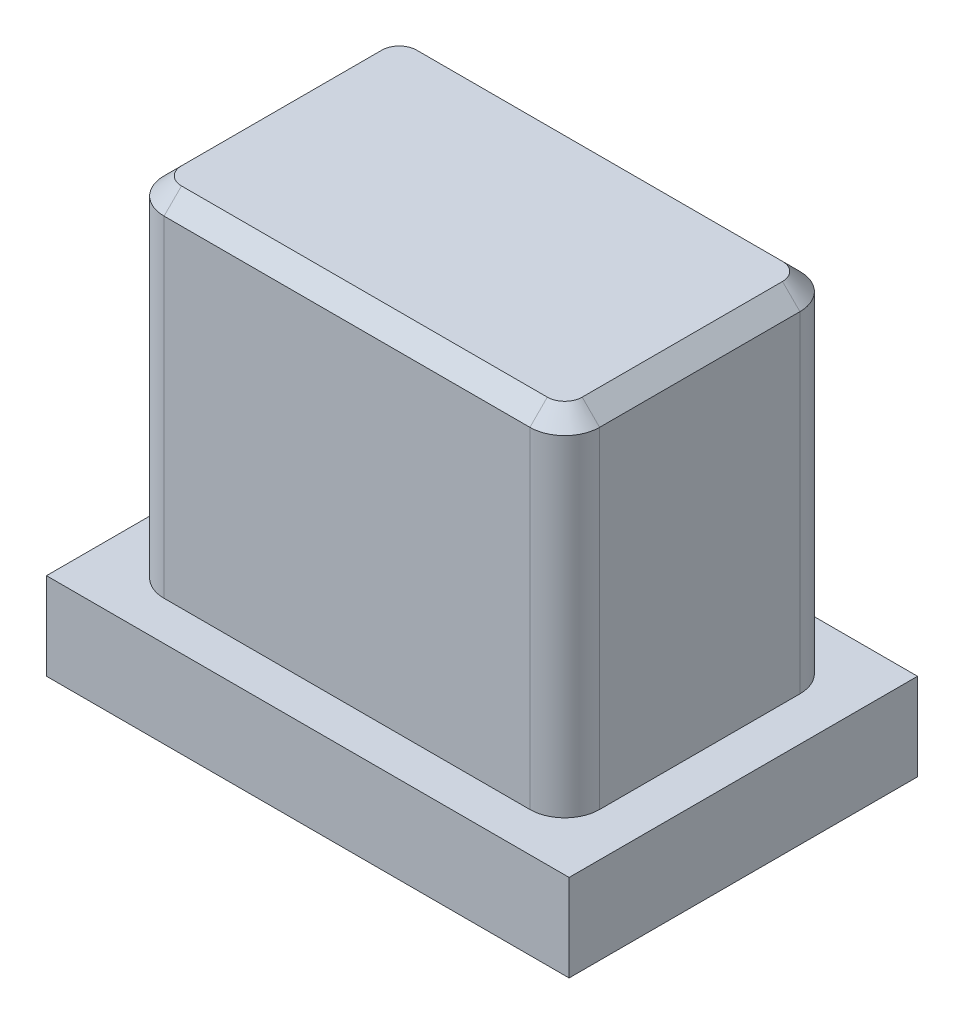
ISO-10303-21;
HEADER;
FILE_DESCRIPTION(('STEP AP214'),'2;1');
FILE_NAME('part.step','',(''),(''),'','','');
FILE_SCHEMA(('AUTOMOTIVE_DESIGN { 1 0 10303 214 1 1 1 1 }'));
ENDSEC;
DATA;
#1=APPLICATION_CONTEXT('core data for automotive mechanical design processes');
#2=APPLICATION_PROTOCOL_DEFINITION('international standard','automotive_design',2000,#1);
#3=PRODUCT_CONTEXT('',#1,'mechanical');
#4=PRODUCT('Part','Part','',(#3));
#5=PRODUCT_RELATED_PRODUCT_CATEGORY('part','',(#4));
#6=PRODUCT_DEFINITION_FORMATION('','',#4);
#7=PRODUCT_DEFINITION_CONTEXT('part definition',#1,'design');
#8=PRODUCT_DEFINITION('design','',#6,#7);
#9=PRODUCT_DEFINITION_SHAPE('','',#8);
#10=(LENGTH_UNIT() NAMED_UNIT(*) SI_UNIT(.MILLI.,.METRE.));
#11=(NAMED_UNIT(*) PLANE_ANGLE_UNIT() SI_UNIT($,.RADIAN.));
#12=(NAMED_UNIT(*) SI_UNIT($,.STERADIAN.) SOLID_ANGLE_UNIT());
#13=UNCERTAINTY_MEASURE_WITH_UNIT(LENGTH_MEASURE(1.E-05),#10,'distance_accuracy_value','');
#14=(GEOMETRIC_REPRESENTATION_CONTEXT(3) GLOBAL_UNCERTAINTY_ASSIGNED_CONTEXT((#13)) GLOBAL_UNIT_ASSIGNED_CONTEXT((#10,
#11,#12)) REPRESENTATION_CONTEXT('',''));
#15=CARTESIAN_POINT('',(0.,0.,0.));
#16=DIRECTION('',(0.,0.,1.));
#17=DIRECTION('',(1.,0.,0.));
#18=AXIS2_PLACEMENT_3D('',#15,#16,#17);
#19=CARTESIAN_POINT('',(0.,20.,-0.840078954138947));
#20=DIRECTION('',(0.,0.,-1.));
#21=DIRECTION('',(-1.,0.,0.));
#22=AXIS2_PLACEMENT_3D('',#19,#20,#21);
#23=PLANE('',#22);
#24=DIRECTION('',(0.,-1.,0.));
#25=VECTOR('',#24,1.);
#26=CARTESIAN_POINT('',(23.,20.,-0.840078954138947));
#27=LINE('',#26,#25);
#28=CARTESIAN_POINT('',(23.,0.,-0.840078954138947));
#29=VERTEX_POINT('',#28);
#30=CARTESIAN_POINT('',(23.,19.,-0.840078954138947));
#31=VERTEX_POINT('',#30);
#32=EDGE_CURVE('E208',#29,#31,#27,.F.);
#33=ORIENTED_EDGE('',*,*,#32,.T.);
#34=DIRECTION('',(-1.,0.,0.));
#35=VECTOR('',#34,1.);
#36=CARTESIAN_POINT('',(2.,19.,-0.840078954138947));
#37=LINE('',#36,#35);
#38=CARTESIAN_POINT('',(2.,19.,-0.840078954138947));
#39=VERTEX_POINT('',#38);
#40=EDGE_CURVE('E11',#31,#39,#37,.T.);
#41=ORIENTED_EDGE('',*,*,#40,.T.);
#42=DIRECTION('',(0.,-1.,0.));
#43=VECTOR('',#42,1.);
#44=CARTESIAN_POINT('',(2.,0.,-0.840078954138947));
#45=LINE('',#44,#43);
#46=CARTESIAN_POINT('',(2.,0.,-0.840078954138947));
#47=VERTEX_POINT('',#46);
#48=EDGE_CURVE('E206',#39,#47,#45,.T.);
#49=ORIENTED_EDGE('',*,*,#48,.T.);
#50=DIRECTION('',(1.,0.,0.));
#51=VECTOR('',#50,1.);
#52=CARTESIAN_POINT('',(0.,0.,-0.840078954138947));
#53=LINE('',#52,#51);
#54=EDGE_CURVE('E185',#47,#29,#53,.T.);
#55=ORIENTED_EDGE('',*,*,#54,.T.);
#56=EDGE_LOOP('',(#33,#41,#49,#55));
#57=FACE_BOUND('',#56,.T.);
#58=ADVANCED_FACE('F34',(#57),#23,.F.);
#59=CARTESIAN_POINT('',(25.,20.,0.));
#60=DIRECTION('',(-1.,0.,0.));
#61=DIRECTION('',(0.,0.,1.));
#62=AXIS2_PLACEMENT_3D('',#59,#60,#61);
#63=PLANE('',#62);
#64=DIRECTION('',(0.,-1.,0.));
#65=VECTOR('',#64,1.);
#66=CARTESIAN_POINT('',(25.,20.,-14.340078954139));
#67=LINE('',#66,#65);
#68=CARTESIAN_POINT('',(25.,0.,-14.340078954139));
#69=VERTEX_POINT('',#68);
#70=CARTESIAN_POINT('',(25.,19.,-14.340078954139));
#71=VERTEX_POINT('',#70);
#72=EDGE_CURVE('E201',#69,#71,#67,.F.);
#73=ORIENTED_EDGE('',*,*,#72,.T.);
#74=DIRECTION('',(0.,0.,1.));
#75=VECTOR('',#74,1.);
#76=CARTESIAN_POINT('',(25.,19.,-2.84007895413895));
#77=LINE('',#76,#75);
#78=CARTESIAN_POINT('',(25.,19.,-2.84007895413895));
#79=VERTEX_POINT('',#78);
#80=EDGE_CURVE('E254',#71,#79,#77,.T.);
#81=ORIENTED_EDGE('',*,*,#80,.T.);
#82=DIRECTION('',(0.,-1.,0.));
#83=VECTOR('',#82,1.);
#84=CARTESIAN_POINT('',(25.,20.,-2.84007895413895));
#85=LINE('',#84,#83);
#86=CARTESIAN_POINT('',(25.,0.,-2.84007895413895));
#87=VERTEX_POINT('',#86);
#88=EDGE_CURVE('E204',#79,#87,#85,.T.);
#89=ORIENTED_EDGE('',*,*,#88,.T.);
#90=DIRECTION('',(0.,0.,-1.));
#91=VECTOR('',#90,1.);
#92=CARTESIAN_POINT('',(25.,0.,0.));
#93=LINE('',#92,#91);
#94=EDGE_CURVE('E192',#87,#69,#93,.T.);
#95=ORIENTED_EDGE('',*,*,#94,.T.);
#96=EDGE_LOOP('',(#73,#81,#89,#95));
#97=FACE_BOUND('',#96,.T.);
#98=ADVANCED_FACE('F327',(#97),#63,.F.);
#99=CARTESIAN_POINT('',(0.,20.,-16.340078954139));
#100=DIRECTION('',(0.,0.,-1.));
#101=DIRECTION('',(-1.,0.,0.));
#102=AXIS2_PLACEMENT_3D('',#99,#100,#101);
#103=PLANE('',#102);
#104=DIRECTION('',(0.,-1.,0.));
#105=VECTOR('',#104,1.);
#106=CARTESIAN_POINT('',(2.,20.,-16.340078954139));
#107=LINE('',#106,#105);
#108=CARTESIAN_POINT('',(2.,0.,-16.340078954139));
#109=VERTEX_POINT('',#108);
#110=CARTESIAN_POINT('',(2.,19.,-16.340078954139));
#111=VERTEX_POINT('',#110);
#112=EDGE_CURVE('E210',#109,#111,#107,.F.);
#113=ORIENTED_EDGE('',*,*,#112,.T.);
#114=DIRECTION('',(1.,0.,0.));
#115=VECTOR('',#114,1.);
#116=CARTESIAN_POINT('',(0.,19.,-16.340078954139));
#117=LINE('',#116,#115);
#118=CARTESIAN_POINT('',(23.,19.,-16.340078954139));
#119=VERTEX_POINT('',#118);
#120=EDGE_CURVE('E228',#111,#119,#117,.T.);
#121=ORIENTED_EDGE('',*,*,#120,.T.);
#122=DIRECTION('',(0.,-1.,0.));
#123=VECTOR('',#122,1.);
#124=CARTESIAN_POINT('',(23.,0.,-16.340078954139));
#125=LINE('',#124,#123);
#126=CARTESIAN_POINT('',(23.,0.,-16.340078954139));
#127=VERTEX_POINT('',#126);
#128=EDGE_CURVE('E213',#119,#127,#125,.T.);
#129=ORIENTED_EDGE('',*,*,#128,.T.);
#130=DIRECTION('',(1.,0.,0.));
#131=VECTOR('',#130,1.);
#132=CARTESIAN_POINT('',(0.,0.,-16.340078954139));
#133=LINE('',#132,#131);
#134=EDGE_CURVE('E195',#109,#127,#133,.T.);
#135=ORIENTED_EDGE('',*,*,#134,.F.);
#136=EDGE_LOOP('',(#113,#121,#129,#135));
#137=FACE_BOUND('',#136,.T.);
#138=ADVANCED_FACE('F309',(#137),#103,.T.);
#139=CARTESIAN_POINT('',(0.,20.,0.));
#140=DIRECTION('',(-1.,0.,0.));
#141=DIRECTION('',(0.,0.,1.));
#142=AXIS2_PLACEMENT_3D('',#139,#140,#141);
#143=PLANE('',#142);
#144=DIRECTION('',(0.,-1.,0.));
#145=VECTOR('',#144,1.);
#146=CARTESIAN_POINT('',(0.,20.,-2.84007895413895));
#147=LINE('',#146,#145);
#148=CARTESIAN_POINT('',(0.,0.,-2.84007895413895));
#149=VERTEX_POINT('',#148);
#150=CARTESIAN_POINT('',(0.,19.,-2.84007895413895));
#151=VERTEX_POINT('',#150);
#152=EDGE_CURVE('E215',#149,#151,#147,.F.);
#153=ORIENTED_EDGE('',*,*,#152,.T.);
#154=DIRECTION('',(0.,0.,-1.));
#155=VECTOR('',#154,1.);
#156=CARTESIAN_POINT('',(0.,19.,0.));
#157=LINE('',#156,#155);
#158=CARTESIAN_POINT('',(0.,19.,-14.340078954139));
#159=VERTEX_POINT('',#158);
#160=EDGE_CURVE('E252',#151,#159,#157,.T.);
#161=ORIENTED_EDGE('',*,*,#160,.T.);
#162=DIRECTION('',(0.,-1.,0.));
#163=VECTOR('',#162,1.);
#164=CARTESIAN_POINT('',(0.,20.,-14.340078954139));
#165=LINE('',#164,#163);
#166=CARTESIAN_POINT('',(0.,0.,-14.340078954139));
#167=VERTEX_POINT('',#166);
#168=EDGE_CURVE('E218',#159,#167,#165,.T.);
#169=ORIENTED_EDGE('',*,*,#168,.T.);
#170=DIRECTION('',(0.,0.,-1.));
#171=VECTOR('',#170,1.);
#172=CARTESIAN_POINT('',(0.,0.,0.));
#173=LINE('',#172,#171);
#174=EDGE_CURVE('E198',#149,#167,#173,.T.);
#175=ORIENTED_EDGE('',*,*,#174,.F.);
#176=EDGE_LOOP('',(#153,#161,#169,#175));
#177=FACE_BOUND('',#176,.T.);
#178=ADVANCED_FACE('F320',(#177),#143,.T.);
#179=CARTESIAN_POINT('',(0.,20.,0.));
#180=DIRECTION('',(0.,1.,0.));
#181=DIRECTION('',(0.,0.,1.));
#182=AXIS2_PLACEMENT_3D('',#179,#180,#181);
#183=PLANE('',#182);
#184=CARTESIAN_POINT('',(23.,20.,-14.340078954139));
#185=DIRECTION('',(0.,1.,0.));
#186=DIRECTION('',(0.,0.,1.));
#187=AXIS2_PLACEMENT_3D('',#184,#185,#186);
#188=CIRCLE('',#187,0.999999999999994);
#189=CARTESIAN_POINT('',(24.,20.,-14.340078954139));
#190=VERTEX_POINT('',#189);
#191=CARTESIAN_POINT('',(23.,20.,-15.3400789541389));
#192=VERTEX_POINT('',#191);
#193=EDGE_CURVE('E241',#190,#192,#188,.T.);
#194=ORIENTED_EDGE('',*,*,#193,.T.);
#195=DIRECTION('',(-1.,0.,0.));
#196=VECTOR('',#195,1.);
#197=CARTESIAN_POINT('',(0.,20.,-15.3400789541389));
#198=LINE('',#197,#196);
#199=CARTESIAN_POINT('',(2.,20.,-15.3400789541389));
#200=VERTEX_POINT('',#199);
#201=EDGE_CURVE('E245',#192,#200,#198,.T.);
#202=ORIENTED_EDGE('',*,*,#201,.T.);
#203=CARTESIAN_POINT('',(2.,20.,-14.340078954139));
#204=DIRECTION('',(0.,1.,0.));
#205=DIRECTION('',(0.,0.,1.));
#206=AXIS2_PLACEMENT_3D('',#203,#204,#205);
#207=CIRCLE('',#206,0.999999999999992);
#208=CARTESIAN_POINT('',(1.00000000000001,20.,-14.340078954139));
#209=VERTEX_POINT('',#208);
#210=EDGE_CURVE('E243',#200,#209,#207,.T.);
#211=ORIENTED_EDGE('',*,*,#210,.T.);
#212=DIRECTION('',(0.,0.,1.));
#213=VECTOR('',#212,1.);
#214=CARTESIAN_POINT('',(1.00000000000001,20.,0.));
#215=LINE('',#214,#213);
#216=CARTESIAN_POINT('',(1.00000000000001,20.,-2.84007895413895));
#217=VERTEX_POINT('',#216);
#218=EDGE_CURVE('E239',#209,#217,#215,.T.);
#219=ORIENTED_EDGE('',*,*,#218,.T.);
#220=CARTESIAN_POINT('',(2.,20.,-2.84007895413895));
#221=DIRECTION('',(0.,1.,0.));
#222=DIRECTION('',(0.,0.,1.));
#223=AXIS2_PLACEMENT_3D('',#220,#221,#222);
#224=CIRCLE('',#223,0.999999999999992);
#225=CARTESIAN_POINT('',(2.,20.,-1.84007895413895));
#226=VERTEX_POINT('',#225);
#227=EDGE_CURVE('E235',#217,#226,#224,.T.);
#228=ORIENTED_EDGE('',*,*,#227,.T.);
#229=DIRECTION('',(1.,0.,0.));
#230=VECTOR('',#229,1.);
#231=CARTESIAN_POINT('',(23.,20.,-1.84007895413895));
#232=LINE('',#231,#230);
#233=CARTESIAN_POINT('',(23.,20.,-1.84007895413895));
#234=VERTEX_POINT('',#233);
#235=EDGE_CURVE('E231',#226,#234,#232,.T.);
#236=ORIENTED_EDGE('',*,*,#235,.T.);
#237=CARTESIAN_POINT('',(23.,20.,-2.84007895413895));
#238=DIRECTION('',(0.,1.,0.));
#239=DIRECTION('',(0.,0.,1.));
#240=AXIS2_PLACEMENT_3D('',#237,#238,#239);
#241=CIRCLE('',#240,0.999999999999994);
#242=CARTESIAN_POINT('',(24.,20.,-2.84007895413895));
#243=VERTEX_POINT('',#242);
#244=EDGE_CURVE('E233',#234,#243,#241,.T.);
#245=ORIENTED_EDGE('',*,*,#244,.T.);
#246=DIRECTION('',(0.,0.,-1.));
#247=VECTOR('',#246,1.);
#248=CARTESIAN_POINT('',(24.,20.,-14.340078954139));
#249=LINE('',#248,#247);
#250=EDGE_CURVE('E237',#243,#190,#249,.T.);
#251=ORIENTED_EDGE('',*,*,#250,.T.);
#252=EDGE_LOOP('',(#194,#202,#211,#219,#228,#236,#245,#251));
#253=FACE_BOUND('',#252,.T.);
#254=ADVANCED_FACE('F289',(#253),#183,.T.);
#255=CARTESIAN_POINT('',(0.,0.,0.));
#256=DIRECTION('',(0.,1.,0.));
#257=DIRECTION('',(0.,0.,1.));
#258=AXIS2_PLACEMENT_3D('',#255,#256,#257);
#259=PLANE('',#258);
#260=DIRECTION('',(0.,0.,-1.));
#261=VECTOR('',#260,1.);
#262=CARTESIAN_POINT('',(27.5,0.,1.40992104586105));
#263=LINE('',#262,#261);
#264=CARTESIAN_POINT('',(27.5,0.,1.40992104586105));
#265=VERTEX_POINT('',#264);
#266=CARTESIAN_POINT('',(27.5,0.,-18.590078954139));
#267=VERTEX_POINT('',#266);
#268=EDGE_CURVE('E179',#265,#267,#263,.T.);
#269=ORIENTED_EDGE('',*,*,#268,.T.);
#270=DIRECTION('',(-1.,0.,0.));
#271=VECTOR('',#270,1.);
#272=CARTESIAN_POINT('',(27.5,0.,-18.590078954139));
#273=LINE('',#272,#271);
#274=CARTESIAN_POINT('',(-2.5,0.,-18.5900789541389));
#275=VERTEX_POINT('',#274);
#276=EDGE_CURVE('E153',#267,#275,#273,.T.);
#277=ORIENTED_EDGE('',*,*,#276,.T.);
#278=DIRECTION('',(0.,0.,-1.));
#279=VECTOR('',#278,1.);
#280=CARTESIAN_POINT('',(-2.5,0.,1.40992104586105));
#281=LINE('',#280,#279);
#282=CARTESIAN_POINT('',(-2.5,0.,1.40992104586105));
#283=VERTEX_POINT('',#282);
#284=EDGE_CURVE('E174',#283,#275,#281,.T.);
#285=ORIENTED_EDGE('',*,*,#284,.F.);
#286=DIRECTION('',(-1.,0.,0.));
#287=VECTOR('',#286,1.);
#288=CARTESIAN_POINT('',(27.5,0.,1.40992104586105));
#289=LINE('',#288,#287);
#290=EDGE_CURVE('E172',#265,#283,#289,.T.);
#291=ORIENTED_EDGE('',*,*,#290,.F.);
#292=EDGE_LOOP('',(#269,#277,#285,#291));
#293=FACE_BOUND('',#292,.T.);
#294=ORIENTED_EDGE('',*,*,#54,.F.);
#295=CARTESIAN_POINT('',(2.,0.,-2.84007895413895));
#296=DIRECTION('',(0.,1.,0.));
#297=DIRECTION('',(0.,0.,1.));
#298=AXIS2_PLACEMENT_3D('',#295,#296,#297);
#299=CIRCLE('',#298,2.);
#300=EDGE_CURVE('E226',#47,#149,#299,.F.);
#301=ORIENTED_EDGE('',*,*,#300,.T.);
#302=ORIENTED_EDGE('',*,*,#174,.T.);
#303=CARTESIAN_POINT('',(2.,0.,-14.340078954139));
#304=DIRECTION('',(0.,1.,0.));
#305=DIRECTION('',(0.,0.,1.));
#306=AXIS2_PLACEMENT_3D('',#303,#304,#305);
#307=CIRCLE('',#306,2.);
#308=EDGE_CURVE('E224',#167,#109,#307,.F.);
#309=ORIENTED_EDGE('',*,*,#308,.T.);
#310=ORIENTED_EDGE('',*,*,#134,.T.);
#311=CARTESIAN_POINT('',(23.,0.,-14.340078954139));
#312=DIRECTION('',(0.,1.,0.));
#313=DIRECTION('',(0.,0.,1.));
#314=AXIS2_PLACEMENT_3D('',#311,#312,#313);
#315=CIRCLE('',#314,2.);
#316=EDGE_CURVE('E222',#127,#69,#315,.F.);
#317=ORIENTED_EDGE('',*,*,#316,.T.);
#318=ORIENTED_EDGE('',*,*,#94,.F.);
#319=CARTESIAN_POINT('',(23.,0.,-2.84007895413895));
#320=DIRECTION('',(0.,1.,0.));
#321=DIRECTION('',(0.,0.,1.));
#322=AXIS2_PLACEMENT_3D('',#319,#320,#321);
#323=CIRCLE('',#322,2.);
#324=EDGE_CURVE('E220',#87,#29,#323,.F.);
#325=ORIENTED_EDGE('',*,*,#324,.T.);
#326=EDGE_LOOP('',(#294,#301,#302,#309,#310,#317,#318,#325));
#327=FACE_BOUND('',#326,.T.);
#328=ADVANCED_FACE('F314',(#293,#327),#259,.T.);
#329=CARTESIAN_POINT('',(27.5,-5.,1.40992104586105));
#330=DIRECTION('',(1.,0.,0.));
#331=DIRECTION('',(0.,0.,-1.));
#332=AXIS2_PLACEMENT_3D('',#329,#330,#331);
#333=PLANE('',#332);
#334=ORIENTED_EDGE('',*,*,#268,.F.);
#335=DIRECTION('',(0.,1.,0.));
#336=VECTOR('',#335,1.);
#337=CARTESIAN_POINT('',(27.5,-5.,1.40992104586105));
#338=LINE('',#337,#336);
#339=CARTESIAN_POINT('',(27.5,-5.,1.40992104586105));
#340=VERTEX_POINT('',#339);
#341=EDGE_CURVE('E170',#340,#265,#338,.T.);
#342=ORIENTED_EDGE('',*,*,#341,.F.);
#343=DIRECTION('',(0.,0.,-1.));
#344=VECTOR('',#343,1.);
#345=CARTESIAN_POINT('',(27.5,-5.,1.40992104586105));
#346=LINE('',#345,#344);
#347=CARTESIAN_POINT('',(27.5,-5.,-18.590078954139));
#348=VERTEX_POINT('',#347);
#349=EDGE_CURVE('E164',#340,#348,#346,.T.);
#350=ORIENTED_EDGE('',*,*,#349,.T.);
#351=DIRECTION('',(0.,1.,0.));
#352=VECTOR('',#351,1.);
#353=CARTESIAN_POINT('',(27.5,-5.,-18.590078954139));
#354=LINE('',#353,#352);
#355=EDGE_CURVE('E148',#348,#267,#354,.T.);
#356=ORIENTED_EDGE('',*,*,#355,.T.);
#357=EDGE_LOOP('',(#334,#342,#350,#356));
#358=FACE_BOUND('',#357,.T.);
#359=ADVANCED_FACE('F169',(#358),#333,.T.);
#360=CARTESIAN_POINT('',(27.5,-5.,1.40992104586105));
#361=DIRECTION('',(0.,0.,-1.));
#362=DIRECTION('',(-1.,0.,0.));
#363=AXIS2_PLACEMENT_3D('',#360,#361,#362);
#364=PLANE('',#363);
#365=ORIENTED_EDGE('',*,*,#290,.T.);
#366=DIRECTION('',(0.,1.,0.));
#367=VECTOR('',#366,1.);
#368=CARTESIAN_POINT('',(-2.5,-5.,1.40992104586105));
#369=LINE('',#368,#367);
#370=CARTESIAN_POINT('',(-2.5,-5.,1.40992104586105));
#371=VERTEX_POINT('',#370);
#372=EDGE_CURVE('E186',#371,#283,#369,.T.);
#373=ORIENTED_EDGE('',*,*,#372,.F.);
#374=DIRECTION('',(-1.,0.,0.));
#375=VECTOR('',#374,1.);
#376=CARTESIAN_POINT('',(27.5,-5.,1.40992104586105));
#377=LINE('',#376,#375);
#378=EDGE_CURVE('E159',#340,#371,#377,.T.);
#379=ORIENTED_EDGE('',*,*,#378,.F.);
#380=ORIENTED_EDGE('',*,*,#341,.T.);
#381=EDGE_LOOP('',(#365,#373,#379,#380));
#382=FACE_BOUND('',#381,.T.);
#383=ADVANCED_FACE('F461',(#382),#364,.F.);
#384=CARTESIAN_POINT('',(-2.5,-5.,1.40992104586105));
#385=DIRECTION('',(1.,0.,0.));
#386=DIRECTION('',(0.,0.,-1.));
#387=AXIS2_PLACEMENT_3D('',#384,#385,#386);
#388=PLANE('',#387);
#389=ORIENTED_EDGE('',*,*,#284,.T.);
#390=DIRECTION('',(0.,1.,0.));
#391=VECTOR('',#390,1.);
#392=CARTESIAN_POINT('',(-2.5,-5.,-18.5900789541389));
#393=LINE('',#392,#391);
#394=CARTESIAN_POINT('',(-2.5,-5.,-18.5900789541389));
#395=VERTEX_POINT('',#394);
#396=EDGE_CURVE('E158',#395,#275,#393,.T.);
#397=ORIENTED_EDGE('',*,*,#396,.F.);
#398=DIRECTION('',(0.,0.,-1.));
#399=VECTOR('',#398,1.);
#400=CARTESIAN_POINT('',(-2.5,-5.,1.40992104586105));
#401=LINE('',#400,#399);
#402=EDGE_CURVE('E166',#371,#395,#401,.T.);
#403=ORIENTED_EDGE('',*,*,#402,.F.);
#404=ORIENTED_EDGE('',*,*,#372,.T.);
#405=EDGE_LOOP('',(#389,#397,#403,#404));
#406=FACE_BOUND('',#405,.T.);
#407=ADVANCED_FACE('F453',(#406),#388,.F.);
#408=CARTESIAN_POINT('',(27.5,-5.,-18.590078954139));
#409=DIRECTION('',(0.,0.,-1.));
#410=DIRECTION('',(-1.,0.,0.));
#411=AXIS2_PLACEMENT_3D('',#408,#409,#410);
#412=PLANE('',#411);
#413=ORIENTED_EDGE('',*,*,#276,.F.);
#414=ORIENTED_EDGE('',*,*,#355,.F.);
#415=DIRECTION('',(-1.,0.,0.));
#416=VECTOR('',#415,1.);
#417=CARTESIAN_POINT('',(27.5,-5.,-18.590078954139));
#418=LINE('',#417,#416);
#419=EDGE_CURVE('E151',#348,#395,#418,.T.);
#420=ORIENTED_EDGE('',*,*,#419,.T.);
#421=ORIENTED_EDGE('',*,*,#396,.T.);
#422=EDGE_LOOP('',(#413,#414,#420,#421));
#423=FACE_BOUND('',#422,.T.);
#424=ADVANCED_FACE('F150',(#423),#412,.T.);
#425=CARTESIAN_POINT('',(0.,-5.,0.));
#426=DIRECTION('',(0.,1.,0.));
#427=DIRECTION('',(0.,0.,1.));
#428=AXIS2_PLACEMENT_3D('',#425,#426,#427);
#429=PLANE('',#428);
#430=ORIENTED_EDGE('',*,*,#349,.F.);
#431=ORIENTED_EDGE('',*,*,#378,.T.);
#432=ORIENTED_EDGE('',*,*,#402,.T.);
#433=ORIENTED_EDGE('',*,*,#419,.F.);
#434=EDGE_LOOP('',(#430,#431,#432,#433));
#435=FACE_BOUND('',#434,.T.);
#436=ADVANCED_FACE('F163',(#435),#429,.F.);
#437=CARTESIAN_POINT('',(23.,20.,-2.84007895413895));
#438=DIRECTION('',(0.,-1.,0.));
#439=DIRECTION('',(0.,0.,-1.));
#440=AXIS2_PLACEMENT_3D('',#437,#438,#439);
#441=CYLINDRICAL_SURFACE('',#440,2.);
#442=ORIENTED_EDGE('',*,*,#88,.F.);
#443=CARTESIAN_POINT('',(23.,19.,-2.84007895413895));
#444=DIRECTION('',(0.,1.,0.));
#445=DIRECTION('',(0.,0.,1.));
#446=AXIS2_PLACEMENT_3D('',#443,#444,#445);
#447=CIRCLE('',#446,2.);
#448=EDGE_CURVE('E43',#79,#31,#447,.F.);
#449=ORIENTED_EDGE('',*,*,#448,.T.);
#450=ORIENTED_EDGE('',*,*,#32,.F.);
#451=ORIENTED_EDGE('',*,*,#324,.F.);
#452=EDGE_LOOP('',(#442,#449,#450,#451));
#453=FACE_BOUND('',#452,.T.);
#454=ADVANCED_FACE('F324',(#453),#441,.T.);
#455=CARTESIAN_POINT('',(23.,20.,-14.340078954139));
#456=DIRECTION('',(0.,1.,0.));
#457=DIRECTION('',(0.,0.,1.));
#458=AXIS2_PLACEMENT_3D('',#455,#456,#457);
#459=CYLINDRICAL_SURFACE('',#458,2.);
#460=ORIENTED_EDGE('',*,*,#128,.F.);
#461=CARTESIAN_POINT('',(23.,19.,-14.340078954139));
#462=DIRECTION('',(0.,1.,0.));
#463=DIRECTION('',(0.,0.,1.));
#464=AXIS2_PLACEMENT_3D('',#461,#462,#463);
#465=CIRCLE('',#464,2.);
#466=EDGE_CURVE('E250',#119,#71,#465,.F.);
#467=ORIENTED_EDGE('',*,*,#466,.T.);
#468=ORIENTED_EDGE('',*,*,#72,.F.);
#469=ORIENTED_EDGE('',*,*,#316,.F.);
#470=EDGE_LOOP('',(#460,#467,#468,#469));
#471=FACE_BOUND('',#470,.T.);
#472=ADVANCED_FACE('F330',(#471),#459,.T.);
#473=CARTESIAN_POINT('',(2.,20.,-14.340078954139));
#474=DIRECTION('',(0.,-1.,0.));
#475=DIRECTION('',(0.,0.,-1.));
#476=AXIS2_PLACEMENT_3D('',#473,#474,#475);
#477=CYLINDRICAL_SURFACE('',#476,2.);
#478=ORIENTED_EDGE('',*,*,#168,.F.);
#479=CARTESIAN_POINT('',(2.,19.,-14.340078954139));
#480=DIRECTION('',(0.,1.,0.));
#481=DIRECTION('',(0.,0.,1.));
#482=AXIS2_PLACEMENT_3D('',#479,#480,#481);
#483=CIRCLE('',#482,2.);
#484=EDGE_CURVE('E248',#159,#111,#483,.F.);
#485=ORIENTED_EDGE('',*,*,#484,.T.);
#486=ORIENTED_EDGE('',*,*,#112,.F.);
#487=ORIENTED_EDGE('',*,*,#308,.F.);
#488=EDGE_LOOP('',(#478,#485,#486,#487));
#489=FACE_BOUND('',#488,.T.);
#490=ADVANCED_FACE('F305',(#489),#477,.T.);
#491=CARTESIAN_POINT('',(2.,20.,-2.84007895413895));
#492=DIRECTION('',(0.,1.,0.));
#493=DIRECTION('',(0.,0.,1.));
#494=AXIS2_PLACEMENT_3D('',#491,#492,#493);
#495=CYLINDRICAL_SURFACE('',#494,2.);
#496=ORIENTED_EDGE('',*,*,#48,.F.);
#497=CARTESIAN_POINT('',(2.,19.,-2.84007895413895));
#498=DIRECTION('',(0.,1.,0.));
#499=DIRECTION('',(0.,0.,1.));
#500=AXIS2_PLACEMENT_3D('',#497,#498,#499);
#501=CIRCLE('',#500,2.);
#502=EDGE_CURVE('E256',#39,#151,#501,.F.);
#503=ORIENTED_EDGE('',*,*,#502,.T.);
#504=ORIENTED_EDGE('',*,*,#152,.F.);
#505=ORIENTED_EDGE('',*,*,#300,.F.);
#506=EDGE_LOOP('',(#496,#503,#504,#505));
#507=FACE_BOUND('',#506,.T.);
#508=ADVANCED_FACE('F322',(#507),#495,.T.);
#509=CARTESIAN_POINT('',(0.,20.,-1.84007895413895));
#510=DIRECTION('',(0.,0.707106781186546,0.707106781186549));
#511=DIRECTION('',(-1.,0.,0.));
#512=AXIS2_PLACEMENT_3D('',#509,#510,#511);
#513=PLANE('',#512);
#514=DIRECTION('',(0.,-0.707106781186549,0.707106781186546));
#515=VECTOR('',#514,1.);
#516=CARTESIAN_POINT('',(23.,20.,-1.84007895413895));
#517=LINE('',#516,#515);
#518=EDGE_CURVE('E274',#234,#31,#517,.T.);
#519=ORIENTED_EDGE('',*,*,#518,.F.);
#520=ORIENTED_EDGE('',*,*,#235,.F.);
#521=DIRECTION('',(0.,0.707106781186549,-0.707106781186546));
#522=VECTOR('',#521,1.);
#523=CARTESIAN_POINT('',(2.,19.,-0.840078954138947));
#524=LINE('',#523,#522);
#525=EDGE_CURVE('E38',#39,#226,#524,.T.);
#526=ORIENTED_EDGE('',*,*,#525,.F.);
#527=ORIENTED_EDGE('',*,*,#40,.F.);
#528=EDGE_LOOP('',(#519,#520,#526,#527));
#529=FACE_BOUND('',#528,.T.);
#530=ADVANCED_FACE('F36',(#529),#513,.T.);
#531=CARTESIAN_POINT('',(2.,20.,-2.84007895413895));
#532=DIRECTION('',(0.,-1.,0.));
#533=DIRECTION('',(0.,0.,-1.));
#534=AXIS2_PLACEMENT_3D('',#531,#532,#533);
#535=CONICAL_SURFACE('',#534,0.999999999999992,0.785398163397447);
#536=ORIENTED_EDGE('',*,*,#525,.T.);
#537=ORIENTED_EDGE('',*,*,#227,.F.);
#538=DIRECTION('',(0.707106781186546,0.707106781186549,0.));
#539=VECTOR('',#538,1.);
#540=CARTESIAN_POINT('',(0.,19.,-2.84007895413895));
#541=LINE('',#540,#539);
#542=EDGE_CURVE('E272',#151,#217,#541,.T.);
#543=ORIENTED_EDGE('',*,*,#542,.F.);
#544=ORIENTED_EDGE('',*,*,#502,.F.);
#545=EDGE_LOOP('',(#536,#537,#543,#544));
#546=FACE_BOUND('',#545,.T.);
#547=ADVANCED_FACE('F284',(#546),#535,.T.);
#548=CARTESIAN_POINT('',(23.,20.,-2.84007895413895));
#549=DIRECTION('',(0.,-1.,0.));
#550=DIRECTION('',(0.,0.,-1.));
#551=AXIS2_PLACEMENT_3D('',#548,#549,#550);
#552=CONICAL_SURFACE('',#551,0.999999999999992,0.785398163397447);
#553=ORIENTED_EDGE('',*,*,#518,.T.);
#554=ORIENTED_EDGE('',*,*,#448,.F.);
#555=DIRECTION('',(0.707106781186546,-0.707106781186549,0.));
#556=VECTOR('',#555,1.);
#557=CARTESIAN_POINT('',(24.,20.,-2.84007895413895));
#558=LINE('',#557,#556);
#559=EDGE_CURVE('E269',#243,#79,#558,.T.);
#560=ORIENTED_EDGE('',*,*,#559,.F.);
#561=ORIENTED_EDGE('',*,*,#244,.F.);
#562=EDGE_LOOP('',(#553,#554,#560,#561));
#563=FACE_BOUND('',#562,.T.);
#564=ADVANCED_FACE('F340',(#563),#552,.T.);
#565=CARTESIAN_POINT('',(0.,19.,0.));
#566=DIRECTION('',(0.707106781186549,-0.707106781186546,0.));
#567=DIRECTION('',(0.,0.,-1.));
#568=AXIS2_PLACEMENT_3D('',#565,#566,#567);
#569=PLANE('',#568);
#570=ORIENTED_EDGE('',*,*,#542,.T.);
#571=ORIENTED_EDGE('',*,*,#218,.F.);
#572=DIRECTION('',(0.707106781186546,0.707106781186549,0.));
#573=VECTOR('',#572,1.);
#574=CARTESIAN_POINT('',(0.,19.,-14.340078954139));
#575=LINE('',#574,#573);
#576=EDGE_CURVE('E266',#159,#209,#575,.T.);
#577=ORIENTED_EDGE('',*,*,#576,.F.);
#578=ORIENTED_EDGE('',*,*,#160,.F.);
#579=EDGE_LOOP('',(#570,#571,#577,#578));
#580=FACE_BOUND('',#579,.T.);
#581=ADVANCED_FACE('F295',(#580),#569,.F.);
#582=CARTESIAN_POINT('',(24.,20.,0.));
#583=DIRECTION('',(0.707106781186549,0.707106781186546,0.));
#584=DIRECTION('',(0.,0.,1.));
#585=AXIS2_PLACEMENT_3D('',#582,#583,#584);
#586=PLANE('',#585);
#587=ORIENTED_EDGE('',*,*,#559,.T.);
#588=ORIENTED_EDGE('',*,*,#80,.F.);
#589=DIRECTION('',(0.707106781186546,-0.707106781186549,0.));
#590=VECTOR('',#589,1.);
#591=CARTESIAN_POINT('',(24.,20.,-14.340078954139));
#592=LINE('',#591,#590);
#593=EDGE_CURVE('E263',#190,#71,#592,.T.);
#594=ORIENTED_EDGE('',*,*,#593,.F.);
#595=ORIENTED_EDGE('',*,*,#250,.F.);
#596=EDGE_LOOP('',(#587,#588,#594,#595));
#597=FACE_BOUND('',#596,.T.);
#598=ADVANCED_FACE('F339',(#597),#586,.T.);
#599=CARTESIAN_POINT('',(2.,20.,-14.340078954139));
#600=DIRECTION('',(0.,-1.,0.));
#601=DIRECTION('',(0.,0.,-1.));
#602=AXIS2_PLACEMENT_3D('',#599,#600,#601);
#603=CONICAL_SURFACE('',#602,0.999999999999992,0.785398163397447);
#604=ORIENTED_EDGE('',*,*,#576,.T.);
#605=ORIENTED_EDGE('',*,*,#210,.F.);
#606=DIRECTION('',(0.,0.707106781186549,0.707106781186546));
#607=VECTOR('',#606,1.);
#608=CARTESIAN_POINT('',(2.,19.,-16.340078954139));
#609=LINE('',#608,#607);
#610=EDGE_CURVE('E261',#111,#200,#609,.T.);
#611=ORIENTED_EDGE('',*,*,#610,.F.);
#612=ORIENTED_EDGE('',*,*,#484,.F.);
#613=EDGE_LOOP('',(#604,#605,#611,#612));
#614=FACE_BOUND('',#613,.T.);
#615=ADVANCED_FACE('F299',(#614),#603,.T.);
#616=CARTESIAN_POINT('',(23.,20.,-14.340078954139));
#617=DIRECTION('',(0.,-1.,0.));
#618=DIRECTION('',(0.,0.,-1.));
#619=AXIS2_PLACEMENT_3D('',#616,#617,#618);
#620=CONICAL_SURFACE('',#619,0.999999999999994,0.785398163397446);
#621=ORIENTED_EDGE('',*,*,#593,.T.);
#622=ORIENTED_EDGE('',*,*,#466,.F.);
#623=DIRECTION('',(0.,-0.707106781186549,-0.707106781186546));
#624=VECTOR('',#623,1.);
#625=CARTESIAN_POINT('',(23.,20.,-15.3400789541389));
#626=LINE('',#625,#624);
#627=EDGE_CURVE('E259',#192,#119,#626,.T.);
#628=ORIENTED_EDGE('',*,*,#627,.F.);
#629=ORIENTED_EDGE('',*,*,#193,.F.);
#630=EDGE_LOOP('',(#621,#622,#628,#629));
#631=FACE_BOUND('',#630,.T.);
#632=ADVANCED_FACE('F334',(#631),#620,.T.);
#633=CARTESIAN_POINT('',(0.,19.,-16.340078954139));
#634=DIRECTION('',(0.,-0.707106781186546,0.707106781186549));
#635=DIRECTION('',(1.,0.,0.));
#636=AXIS2_PLACEMENT_3D('',#633,#634,#635);
#637=PLANE('',#636);
#638=ORIENTED_EDGE('',*,*,#610,.T.);
#639=ORIENTED_EDGE('',*,*,#201,.F.);
#640=ORIENTED_EDGE('',*,*,#627,.T.);
#641=ORIENTED_EDGE('',*,*,#120,.F.);
#642=EDGE_LOOP('',(#638,#639,#640,#641));
#643=FACE_BOUND('',#642,.T.);
#644=ADVANCED_FACE('F364',(#643),#637,.F.);
#645=CLOSED_SHELL('',(#58,#98,#138,#178,#254,#328,#359,#383,#407,#424,#436,#454,#472,#490,#508,
#530,#547,#564,#581,#598,#615,#632,#644));
#646=MANIFOLD_SOLID_BREP('B2',#645);
#647=ADVANCED_BREP_SHAPE_REPRESENTATION('',(#18,#646),#14);
#648=SHAPE_DEFINITION_REPRESENTATION(#9,#647);
ENDSEC;
END-ISO-10303-21;
